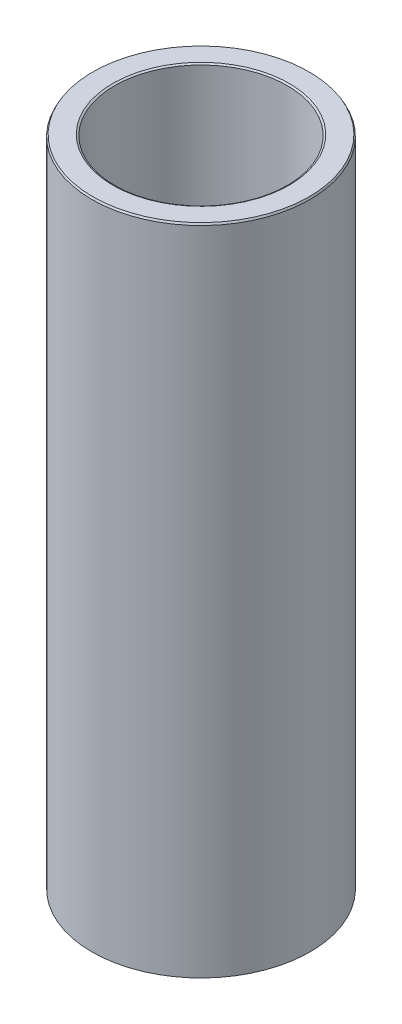
ISO-10303-21;
HEADER;
FILE_DESCRIPTION(('STEP AP214'),'2;1');
FILE_NAME('part.step','',(''),(''),'','','');
FILE_SCHEMA(('AUTOMOTIVE_DESIGN { 1 0 10303 214 1 1 1 1 }'));
ENDSEC;
DATA;
#1=APPLICATION_CONTEXT('core data for automotive mechanical design processes');
#2=APPLICATION_PROTOCOL_DEFINITION('international standard','automotive_design',2000,#1);
#3=PRODUCT_CONTEXT('',#1,'mechanical');
#4=PRODUCT('Part','Part','',(#3));
#5=PRODUCT_RELATED_PRODUCT_CATEGORY('part','',(#4));
#6=PRODUCT_DEFINITION_FORMATION('','',#4);
#7=PRODUCT_DEFINITION_CONTEXT('part definition',#1,'design');
#8=PRODUCT_DEFINITION('design','',#6,#7);
#9=PRODUCT_DEFINITION_SHAPE('','',#8);
#10=(LENGTH_UNIT() NAMED_UNIT(*) SI_UNIT(.MILLI.,.METRE.));
#11=(NAMED_UNIT(*) PLANE_ANGLE_UNIT() SI_UNIT($,.RADIAN.));
#12=(NAMED_UNIT(*) SI_UNIT($,.STERADIAN.) SOLID_ANGLE_UNIT());
#13=UNCERTAINTY_MEASURE_WITH_UNIT(LENGTH_MEASURE(1.E-05),#10,'distance_accuracy_value','');
#14=(GEOMETRIC_REPRESENTATION_CONTEXT(3) GLOBAL_UNCERTAINTY_ASSIGNED_CONTEXT((#13)) GLOBAL_UNIT_ASSIGNED_CONTEXT((#10,
#11,#12)) REPRESENTATION_CONTEXT('',''));
#15=CARTESIAN_POINT('',(0.,0.,0.));
#16=DIRECTION('',(0.,0.,1.));
#17=DIRECTION('',(1.,0.,0.));
#18=AXIS2_PLACEMENT_3D('',#15,#16,#17);
#19=CARTESIAN_POINT('',(0.,224.755706659969,0.));
#20=DIRECTION('',(0.,-1.,0.));
#21=DIRECTION('',(0.,0.,-1.));
#22=AXIS2_PLACEMENT_3D('',#19,#20,#21);
#23=CYLINDRICAL_SURFACE('',#22,37.5);
#24=CARTESIAN_POINT('',(0.,0.358907193034358,0.));
#25=DIRECTION('',(0.,1.,0.));
#26=DIRECTION('',(0.,0.,1.));
#27=AXIS2_PLACEMENT_3D('',#24,#25,#26);
#28=CIRCLE('',#27,37.5);
#29=CARTESIAN_POINT('',(0.,0.358907193034358,37.5));
#30=VERTEX_POINT('',#29);
#31=EDGE_CURVE('E10',#30,#30,#28,.T.);
#32=ORIENTED_EDGE('',*,*,#31,.T.);
#33=EDGE_LOOP('',(#32));
#34=FACE_BOUND('',#33,.T.);
#35=CARTESIAN_POINT('',(0.,224.134061166432,0.));
#36=DIRECTION('',(0.,1.,0.));
#37=DIRECTION('',(0.,0.,1.));
#38=AXIS2_PLACEMENT_3D('',#35,#36,#37);
#39=CIRCLE('',#38,37.5);
#40=CARTESIAN_POINT('',(0.,224.134061166432,37.5));
#41=VERTEX_POINT('',#40);
#42=EDGE_CURVE('E50',#41,#41,#39,.F.);
#43=ORIENTED_EDGE('',*,*,#42,.T.);
#44=EDGE_LOOP('',(#43));
#45=FACE_BOUND('',#44,.T.);
#46=ADVANCED_FACE('F39',(#34,#45),#23,.T.);
#47=CARTESIAN_POINT('',(0.,224.755706659969,0.));
#48=DIRECTION('',(0.,1.,0.));
#49=DIRECTION('',(0.,0.,1.));
#50=AXIS2_PLACEMENT_3D('',#47,#48,#49);
#51=PLANE('',#50);
#52=CARTESIAN_POINT('',(0.,224.755706659969,0.));
#53=DIRECTION('',(0.,1.,0.));
#54=DIRECTION('',(0.,0.,1.));
#55=AXIS2_PLACEMENT_3D('',#52,#53,#54);
#56=CIRCLE('',#55,30.2922241575895);
#57=CARTESIAN_POINT('',(0.,224.755706659969,30.2922241575895));
#58=VERTEX_POINT('',#57);
#59=EDGE_CURVE('E58',#58,#58,#56,.F.);
#60=ORIENTED_EDGE('',*,*,#59,.T.);
#61=EDGE_LOOP('',(#60));
#62=FACE_BOUND('',#61,.T.);
#63=CARTESIAN_POINT('',(0.,224.755706659969,0.));
#64=DIRECTION('',(0.,1.,0.));
#65=DIRECTION('',(0.,0.,1.));
#66=AXIS2_PLACEMENT_3D('',#63,#64,#65);
#67=CIRCLE('',#66,37.1410928069657);
#68=CARTESIAN_POINT('',(0.,224.755706659969,37.1410928069657));
#69=VERTEX_POINT('',#68);
#70=EDGE_CURVE('E61',#69,#69,#67,.T.);
#71=ORIENTED_EDGE('',*,*,#70,.T.);
#72=EDGE_LOOP('',(#71));
#73=FACE_BOUND('',#72,.T.);
#74=ADVANCED_FACE('F88',(#62,#73),#51,.T.);
#75=CARTESIAN_POINT('',(0.,0.,0.));
#76=DIRECTION('',(0.,1.,0.));
#77=DIRECTION('',(0.,0.,1.));
#78=AXIS2_PLACEMENT_3D('',#75,#76,#77);
#79=PLANE('',#78);
#80=CARTESIAN_POINT('',(0.,0.,0.));
#81=DIRECTION('',(0.,1.,0.));
#82=DIRECTION('',(0.,0.,1.));
#83=AXIS2_PLACEMENT_3D('',#80,#81,#82);
#84=CIRCLE('',#83,30.0294858570864);
#85=CARTESIAN_POINT('',(0.,0.,30.0294858570864));
#86=VERTEX_POINT('',#85);
#87=EDGE_CURVE('E51',#86,#86,#84,.T.);
#88=ORIENTED_EDGE('',*,*,#87,.T.);
#89=EDGE_LOOP('',(#88));
#90=FACE_BOUND('',#89,.T.);
#91=CARTESIAN_POINT('',(0.,0.,0.));
#92=DIRECTION('',(0.,1.,0.));
#93=DIRECTION('',(0.,0.,1.));
#94=AXIS2_PLACEMENT_3D('',#91,#92,#93);
#95=CIRCLE('',#94,36.8783545064626);
#96=CARTESIAN_POINT('',(0.,0.,36.8783545064626));
#97=VERTEX_POINT('',#96);
#98=EDGE_CURVE('E54',#97,#97,#95,.F.);
#99=ORIENTED_EDGE('',*,*,#98,.T.);
#100=EDGE_LOOP('',(#99));
#101=FACE_BOUND('',#100,.T.);
#102=ADVANCED_FACE('F83',(#90,#101),#79,.F.);
#103=CARTESIAN_POINT('',(0.,224.755706659969,0.));
#104=DIRECTION('',(0.,-1.,0.));
#105=DIRECTION('',(0.,0.,-1.));
#106=AXIS2_PLACEMENT_3D('',#103,#104,#105);
#107=CYLINDRICAL_SURFACE('',#106,29.6705786640521);
#108=CARTESIAN_POINT('',(0.,224.396799466935,0.));
#109=DIRECTION('',(0.,1.,0.));
#110=DIRECTION('',(0.,0.,1.));
#111=AXIS2_PLACEMENT_3D('',#108,#109,#110);
#112=CIRCLE('',#111,29.6705786640521);
#113=CARTESIAN_POINT('',(0.,224.396799466935,29.6705786640521));
#114=VERTEX_POINT('',#113);
#115=EDGE_CURVE('E67',#114,#114,#112,.T.);
#116=ORIENTED_EDGE('',*,*,#115,.T.);
#117=EDGE_LOOP('',(#116));
#118=FACE_BOUND('',#117,.T.);
#119=CARTESIAN_POINT('',(0.,0.621645493537326,0.));
#120=DIRECTION('',(0.,1.,0.));
#121=DIRECTION('',(0.,0.,1.));
#122=AXIS2_PLACEMENT_3D('',#119,#120,#121);
#123=CIRCLE('',#122,29.6705786640521);
#124=CARTESIAN_POINT('',(0.,0.621645493537326,29.6705786640521));
#125=VERTEX_POINT('',#124);
#126=EDGE_CURVE('E69',#125,#125,#123,.F.);
#127=ORIENTED_EDGE('',*,*,#126,.T.);
#128=EDGE_LOOP('',(#127));
#129=FACE_BOUND('',#128,.T.);
#130=ADVANCED_FACE('F71',(#118,#129),#107,.F.);
#131=CARTESIAN_POINT('',(0.,224.396799466935,0.));
#132=DIRECTION('',(0.,1.,0.));
#133=DIRECTION('',(0.,0.,1.));
#134=AXIS2_PLACEMENT_3D('',#131,#132,#133);
#135=CONICAL_SURFACE('',#134,29.6705786640521,1.04719755119658);
#136=ORIENTED_EDGE('',*,*,#59,.F.);
#137=EDGE_LOOP('',(#136));
#138=FACE_BOUND('',#137,.T.);
#139=ORIENTED_EDGE('',*,*,#115,.F.);
#140=EDGE_LOOP('',(#139));
#141=FACE_BOUND('',#140,.T.);
#142=ADVANCED_FACE('F77',(#138,#141),#135,.F.);
#143=CARTESIAN_POINT('',(0.,0.,0.));
#144=DIRECTION('',(0.,-1.,0.));
#145=DIRECTION('',(0.,0.,-1.));
#146=AXIS2_PLACEMENT_3D('',#143,#144,#145);
#147=CONICAL_SURFACE('',#146,30.0294858570864,0.523598775598298);
#148=ORIENTED_EDGE('',*,*,#126,.F.);
#149=EDGE_LOOP('',(#148));
#150=FACE_BOUND('',#149,.T.);
#151=ORIENTED_EDGE('',*,*,#87,.F.);
#152=EDGE_LOOP('',(#151));
#153=FACE_BOUND('',#152,.T.);
#154=ADVANCED_FACE('F73',(#150,#153),#147,.F.);
#155=CARTESIAN_POINT('',(0.,0.358907193034358,0.));
#156=DIRECTION('',(0.,1.,0.));
#157=DIRECTION('',(0.,0.,1.));
#158=AXIS2_PLACEMENT_3D('',#155,#156,#157);
#159=CONICAL_SURFACE('',#158,37.5,1.04719755119656);
#160=ORIENTED_EDGE('',*,*,#98,.F.);
#161=EDGE_LOOP('',(#160));
#162=FACE_BOUND('',#161,.T.);
#163=ORIENTED_EDGE('',*,*,#31,.F.);
#164=EDGE_LOOP('',(#163));
#165=FACE_BOUND('',#164,.T.);
#166=ADVANCED_FACE('F76',(#162,#165),#159,.T.);
#167=CARTESIAN_POINT('',(0.,224.755706659969,0.));
#168=DIRECTION('',(0.,-1.,0.));
#169=DIRECTION('',(0.,0.,-1.));
#170=AXIS2_PLACEMENT_3D('',#167,#168,#169);
#171=CONICAL_SURFACE('',#170,37.1410928069657,0.523598775598286);
#172=ORIENTED_EDGE('',*,*,#42,.F.);
#173=EDGE_LOOP('',(#172));
#174=FACE_BOUND('',#173,.T.);
#175=ORIENTED_EDGE('',*,*,#70,.F.);
#176=EDGE_LOOP('',(#175));
#177=FACE_BOUND('',#176,.T.);
#178=ADVANCED_FACE('F45',(#174,#177),#171,.T.);
#179=CLOSED_SHELL('',(#46,#74,#102,#130,#142,#154,#166,#178));
#180=MANIFOLD_SOLID_BREP('B2',#179);
#181=ADVANCED_BREP_SHAPE_REPRESENTATION('',(#18,#180),#14);
#182=SHAPE_DEFINITION_REPRESENTATION(#9,#181);
ENDSEC;
END-ISO-10303-21;
